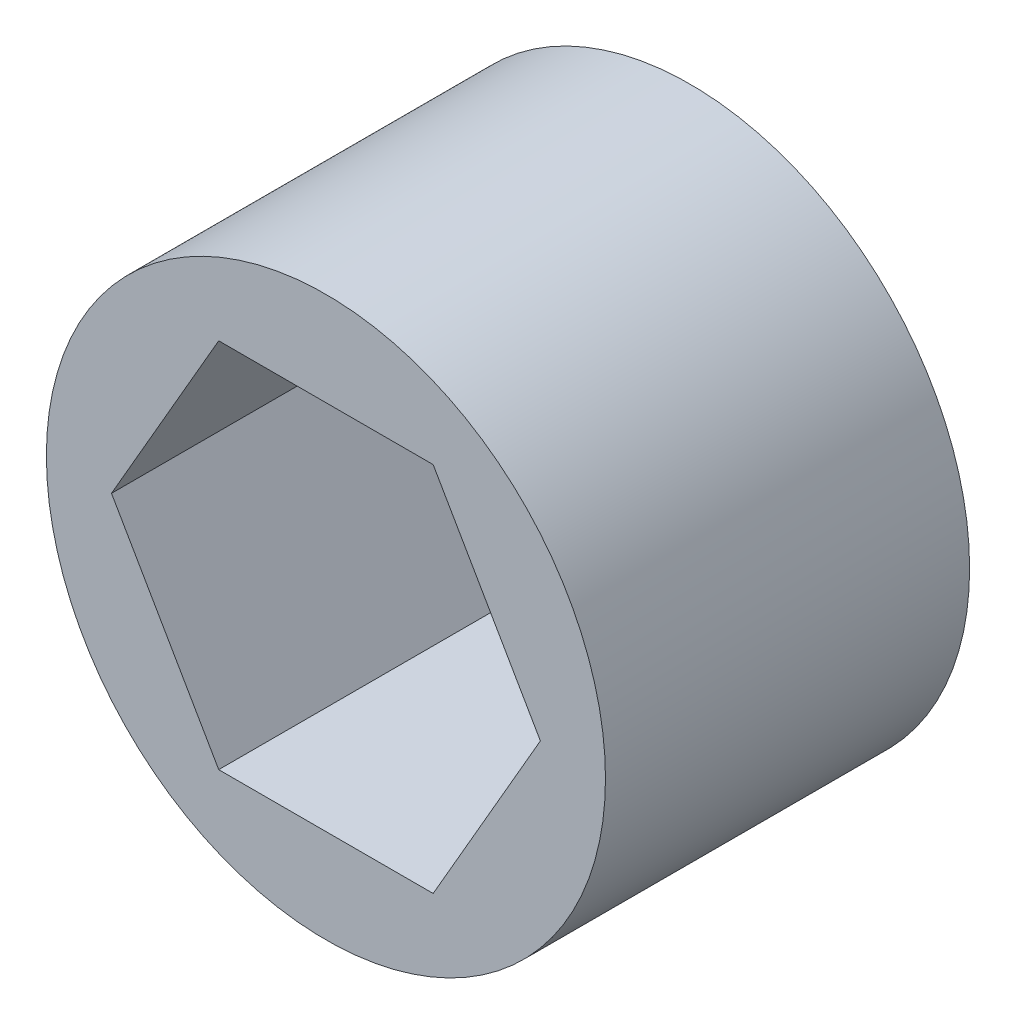
ISO-10303-21;
HEADER;
FILE_DESCRIPTION(('STEP AP214'),'2;1');
FILE_NAME('part.step','',(''),(''),'','','');
FILE_SCHEMA(('AUTOMOTIVE_DESIGN { 1 0 10303 214 1 1 1 1 }'));
ENDSEC;
DATA;
#1=APPLICATION_CONTEXT('core data for automotive mechanical design processes');
#2=APPLICATION_PROTOCOL_DEFINITION('international standard','automotive_design',2000,#1);
#3=PRODUCT_CONTEXT('',#1,'mechanical');
#4=PRODUCT('Part','Part','',(#3));
#5=PRODUCT_RELATED_PRODUCT_CATEGORY('part','',(#4));
#6=PRODUCT_DEFINITION_FORMATION('','',#4);
#7=PRODUCT_DEFINITION_CONTEXT('part definition',#1,'design');
#8=PRODUCT_DEFINITION('design','',#6,#7);
#9=PRODUCT_DEFINITION_SHAPE('','',#8);
#10=(LENGTH_UNIT() NAMED_UNIT(*) SI_UNIT(.MILLI.,.METRE.));
#11=(NAMED_UNIT(*) PLANE_ANGLE_UNIT() SI_UNIT($,.RADIAN.));
#12=(NAMED_UNIT(*) SI_UNIT($,.STERADIAN.) SOLID_ANGLE_UNIT());
#13=UNCERTAINTY_MEASURE_WITH_UNIT(LENGTH_MEASURE(1.E-05),#10,'distance_accuracy_value','');
#14=(GEOMETRIC_REPRESENTATION_CONTEXT(3) GLOBAL_UNCERTAINTY_ASSIGNED_CONTEXT((#13)) GLOBAL_UNIT_ASSIGNED_CONTEXT((#10,
#11,#12)) REPRESENTATION_CONTEXT('',''));
#15=CARTESIAN_POINT('',(0.,0.,0.));
#16=DIRECTION('',(0.,0.,1.));
#17=DIRECTION('',(1.,0.,0.));
#18=AXIS2_PLACEMENT_3D('',#15,#16,#17);
#19=CARTESIAN_POINT('',(-7.47899538708241,0.,6.35));
#20=DIRECTION('',(0.866025403784439,0.5,0.));
#21=DIRECTION('',(-0.5,0.866025403784439,0.));
#22=AXIS2_PLACEMENT_3D('',#19,#20,#21);
#23=PLANE('',#22);
#24=DIRECTION('',(-0.5,0.866025403784438,0.));
#25=VECTOR('',#24,1.);
#26=CARTESIAN_POINT('',(-3.73949769354121,-6.477,6.35));
#27=LINE('',#26,#25);
#28=CARTESIAN_POINT('',(-3.73949769354121,-6.477,6.35));
#29=VERTEX_POINT('',#28);
#30=CARTESIAN_POINT('',(-7.47899538708241,0.,6.35));
#31=VERTEX_POINT('',#30);
#32=EDGE_CURVE('E84',#29,#31,#27,.T.);
#33=ORIENTED_EDGE('',*,*,#32,.F.);
#34=DIRECTION('',(0.,0.,1.));
#35=VECTOR('',#34,1.);
#36=CARTESIAN_POINT('',(-3.73949769354121,-6.477,6.35));
#37=LINE('',#36,#35);
#38=CARTESIAN_POINT('',(-3.73949769354121,-6.477,-6.35));
#39=VERTEX_POINT('',#38);
#40=EDGE_CURVE('E76',#39,#29,#37,.T.);
#41=ORIENTED_EDGE('',*,*,#40,.F.);
#42=DIRECTION('',(-0.5,0.866025403784439,0.));
#43=VECTOR('',#42,1.);
#44=CARTESIAN_POINT('',(-3.73949769354121,-6.477,-6.35));
#45=LINE('',#44,#43);
#46=CARTESIAN_POINT('',(-7.47899538708241,0.,-6.35));
#47=VERTEX_POINT('',#46);
#48=EDGE_CURVE('E116',#39,#47,#45,.T.);
#49=ORIENTED_EDGE('',*,*,#48,.T.);
#50=DIRECTION('',(0.,0.,1.));
#51=VECTOR('',#50,1.);
#52=CARTESIAN_POINT('',(-7.47899538708241,0.,6.35));
#53=LINE('',#52,#51);
#54=EDGE_CURVE('E101',#31,#47,#53,.F.);
#55=ORIENTED_EDGE('',*,*,#54,.F.);
#56=EDGE_LOOP('',(#33,#41,#49,#55));
#57=FACE_BOUND('',#56,.T.);
#58=ADVANCED_FACE('F17',(#57),#23,.T.);
#59=CARTESIAN_POINT('',(-3.73949769354121,6.477,6.35));
#60=DIRECTION('',(0.866025403784439,-0.5,0.));
#61=DIRECTION('',(0.5,0.866025403784439,0.));
#62=AXIS2_PLACEMENT_3D('',#59,#60,#61);
#63=PLANE('',#62);
#64=DIRECTION('',(0.5,0.866025403784439,0.));
#65=VECTOR('',#64,1.);
#66=CARTESIAN_POINT('',(-7.47899538708242,0.,6.35));
#67=LINE('',#66,#65);
#68=CARTESIAN_POINT('',(-3.73949769354121,6.477,6.35));
#69=VERTEX_POINT('',#68);
#70=EDGE_CURVE('E109',#31,#69,#67,.T.);
#71=ORIENTED_EDGE('',*,*,#70,.F.);
#72=ORIENTED_EDGE('',*,*,#54,.T.);
#73=DIRECTION('',(0.5,0.866025403784439,0.));
#74=VECTOR('',#73,1.);
#75=CARTESIAN_POINT('',(-7.47899538708241,0.,-6.35));
#76=LINE('',#75,#74);
#77=CARTESIAN_POINT('',(-3.73949769354121,6.477,-6.35));
#78=VERTEX_POINT('',#77);
#79=EDGE_CURVE('E107',#47,#78,#76,.T.);
#80=ORIENTED_EDGE('',*,*,#79,.T.);
#81=DIRECTION('',(0.,0.,1.));
#82=VECTOR('',#81,1.);
#83=CARTESIAN_POINT('',(-3.73949769354121,6.477,6.35));
#84=LINE('',#83,#82);
#85=EDGE_CURVE('E98',#69,#78,#84,.F.);
#86=ORIENTED_EDGE('',*,*,#85,.F.);
#87=EDGE_LOOP('',(#71,#72,#80,#86));
#88=FACE_BOUND('',#87,.T.);
#89=ADVANCED_FACE('F106',(#88),#63,.T.);
#90=CARTESIAN_POINT('',(3.7394976935412,6.477,6.35));
#91=DIRECTION('',(0.,-1.,0.));
#92=DIRECTION('',(1.,0.,0.));
#93=AXIS2_PLACEMENT_3D('',#90,#91,#92);
#94=PLANE('',#93);
#95=DIRECTION('',(1.,0.,0.));
#96=VECTOR('',#95,1.);
#97=CARTESIAN_POINT('',(0.,6.477,6.35));
#98=LINE('',#97,#96);
#99=CARTESIAN_POINT('',(3.7394976935412,6.477,6.35));
#100=VERTEX_POINT('',#99);
#101=EDGE_CURVE('E126',#69,#100,#98,.T.);
#102=ORIENTED_EDGE('',*,*,#101,.F.);
#103=ORIENTED_EDGE('',*,*,#85,.T.);
#104=DIRECTION('',(1.,0.,0.));
#105=VECTOR('',#104,1.);
#106=CARTESIAN_POINT('',(0.,6.477,-6.35));
#107=LINE('',#106,#105);
#108=CARTESIAN_POINT('',(3.7394976935412,6.477,-6.35));
#109=VERTEX_POINT('',#108);
#110=EDGE_CURVE('E118',#78,#109,#107,.T.);
#111=ORIENTED_EDGE('',*,*,#110,.T.);
#112=DIRECTION('',(0.,0.,1.));
#113=VECTOR('',#112,1.);
#114=CARTESIAN_POINT('',(3.7394976935412,6.47700000000001,6.35));
#115=LINE('',#114,#113);
#116=EDGE_CURVE('E95',#100,#109,#115,.F.);
#117=ORIENTED_EDGE('',*,*,#116,.F.);
#118=EDGE_LOOP('',(#102,#103,#111,#117));
#119=FACE_BOUND('',#118,.T.);
#120=ADVANCED_FACE('F135',(#119),#94,.T.);
#121=CARTESIAN_POINT('',(7.47899538708241,0.,6.35));
#122=DIRECTION('',(-0.866025403784439,-0.5,0.));
#123=DIRECTION('',(0.5,-0.866025403784439,0.));
#124=AXIS2_PLACEMENT_3D('',#121,#122,#123);
#125=PLANE('',#124);
#126=DIRECTION('',(0.5,-0.866025403784438,0.));
#127=VECTOR('',#126,1.);
#128=CARTESIAN_POINT('',(3.7394976935412,6.477,6.35));
#129=LINE('',#128,#127);
#130=CARTESIAN_POINT('',(7.47899538708242,0.,6.35));
#131=VERTEX_POINT('',#130);
#132=EDGE_CURVE('E89',#100,#131,#129,.T.);
#133=ORIENTED_EDGE('',*,*,#132,.F.);
#134=ORIENTED_EDGE('',*,*,#116,.T.);
#135=DIRECTION('',(0.5,-0.866025403784438,0.));
#136=VECTOR('',#135,1.);
#137=CARTESIAN_POINT('',(3.7394976935412,6.477,-6.35));
#138=LINE('',#137,#136);
#139=CARTESIAN_POINT('',(7.47899538708241,0.,-6.35));
#140=VERTEX_POINT('',#139);
#141=EDGE_CURVE('E120',#109,#140,#138,.T.);
#142=ORIENTED_EDGE('',*,*,#141,.T.);
#143=DIRECTION('',(0.,0.,1.));
#144=VECTOR('',#143,1.);
#145=CARTESIAN_POINT('',(7.47899538708242,0.,6.35));
#146=LINE('',#145,#144);
#147=EDGE_CURVE('E65',#131,#140,#146,.F.);
#148=ORIENTED_EDGE('',*,*,#147,.F.);
#149=EDGE_LOOP('',(#133,#134,#142,#148));
#150=FACE_BOUND('',#149,.T.);
#151=ADVANCED_FACE('F132',(#150),#125,.T.);
#152=CARTESIAN_POINT('',(3.73949769354121,-6.477,6.35));
#153=DIRECTION('',(-0.866025403784439,0.5,0.));
#154=DIRECTION('',(-0.5,-0.866025403784439,0.));
#155=AXIS2_PLACEMENT_3D('',#152,#153,#154);
#156=PLANE('',#155);
#157=DIRECTION('',(-0.5,-0.866025403784439,0.));
#158=VECTOR('',#157,1.);
#159=CARTESIAN_POINT('',(7.47899538708241,0.,6.35));
#160=LINE('',#159,#158);
#161=CARTESIAN_POINT('',(3.73949769354121,-6.477,6.35));
#162=VERTEX_POINT('',#161);
#163=EDGE_CURVE('E71',#131,#162,#160,.T.);
#164=ORIENTED_EDGE('',*,*,#163,.F.);
#165=ORIENTED_EDGE('',*,*,#147,.T.);
#166=DIRECTION('',(-0.5,-0.866025403784439,0.));
#167=VECTOR('',#166,1.);
#168=CARTESIAN_POINT('',(7.47899538708241,0.,-6.35));
#169=LINE('',#168,#167);
#170=CARTESIAN_POINT('',(3.73949769354121,-6.477,-6.35));
#171=VERTEX_POINT('',#170);
#172=EDGE_CURVE('E33',#140,#171,#169,.T.);
#173=ORIENTED_EDGE('',*,*,#172,.T.);
#174=DIRECTION('',(0.,0.,1.));
#175=VECTOR('',#174,1.);
#176=CARTESIAN_POINT('',(3.73949769354121,-6.477,6.35));
#177=LINE('',#176,#175);
#178=EDGE_CURVE('E67',#162,#171,#177,.F.);
#179=ORIENTED_EDGE('',*,*,#178,.F.);
#180=EDGE_LOOP('',(#164,#165,#173,#179));
#181=FACE_BOUND('',#180,.T.);
#182=ADVANCED_FACE('F69',(#181),#156,.T.);
#183=CARTESIAN_POINT('',(-3.73949769354121,-6.477,6.35));
#184=DIRECTION('',(0.,1.,0.));
#185=DIRECTION('',(0.,0.,1.));
#186=AXIS2_PLACEMENT_3D('',#183,#184,#185);
#187=PLANE('',#186);
#188=DIRECTION('',(1.,0.,0.));
#189=VECTOR('',#188,1.);
#190=CARTESIAN_POINT('',(0.,-6.477,6.35));
#191=LINE('',#190,#189);
#192=EDGE_CURVE('E79',#162,#29,#191,.F.);
#193=ORIENTED_EDGE('',*,*,#192,.F.);
#194=ORIENTED_EDGE('',*,*,#178,.T.);
#195=DIRECTION('',(1.,0.,0.));
#196=VECTOR('',#195,1.);
#197=CARTESIAN_POINT('',(0.,-6.477,-6.35));
#198=LINE('',#197,#196);
#199=EDGE_CURVE('E128',#171,#39,#198,.F.);
#200=ORIENTED_EDGE('',*,*,#199,.T.);
#201=ORIENTED_EDGE('',*,*,#40,.T.);
#202=EDGE_LOOP('',(#193,#194,#200,#201));
#203=FACE_BOUND('',#202,.T.);
#204=ADVANCED_FACE('F80',(#203),#187,.T.);
#205=CARTESIAN_POINT('',(0.,0.,6.35));
#206=DIRECTION('',(0.,0.,1.));
#207=DIRECTION('',(1.,0.,0.));
#208=AXIS2_PLACEMENT_3D('',#205,#206,#207);
#209=PLANE('',#208);
#210=ORIENTED_EDGE('',*,*,#101,.T.);
#211=ORIENTED_EDGE('',*,*,#132,.T.);
#212=ORIENTED_EDGE('',*,*,#163,.T.);
#213=ORIENTED_EDGE('',*,*,#192,.T.);
#214=ORIENTED_EDGE('',*,*,#32,.T.);
#215=ORIENTED_EDGE('',*,*,#70,.T.);
#216=EDGE_LOOP('',(#210,#211,#212,#213,#214,#215));
#217=FACE_BOUND('',#216,.T.);
#218=CARTESIAN_POINT('',(0.,0.,6.35));
#219=DIRECTION('',(0.,0.,-1.));
#220=DIRECTION('',(-1.,0.,0.));
#221=AXIS2_PLACEMENT_3D('',#218,#219,#220);
#222=CIRCLE('',#221,9.75);
#223=CARTESIAN_POINT('',(-9.75,0.,6.35));
#224=VERTEX_POINT('',#223);
#225=EDGE_CURVE('E20',#224,#224,#222,.T.);
#226=ORIENTED_EDGE('',*,*,#225,.F.);
#227=EDGE_LOOP('',(#226));
#228=FACE_BOUND('',#227,.T.);
#229=ADVANCED_FACE('F87',(#217,#228),#209,.T.);
#230=CARTESIAN_POINT('',(0.,0.,-6.35));
#231=DIRECTION('',(0.,0.,1.));
#232=DIRECTION('',(1.,0.,0.));
#233=AXIS2_PLACEMENT_3D('',#230,#231,#232);
#234=PLANE('',#233);
#235=ORIENTED_EDGE('',*,*,#172,.F.);
#236=ORIENTED_EDGE('',*,*,#141,.F.);
#237=ORIENTED_EDGE('',*,*,#110,.F.);
#238=ORIENTED_EDGE('',*,*,#79,.F.);
#239=ORIENTED_EDGE('',*,*,#48,.F.);
#240=ORIENTED_EDGE('',*,*,#199,.F.);
#241=EDGE_LOOP('',(#235,#236,#237,#238,#239,#240));
#242=FACE_BOUND('',#241,.T.);
#243=CARTESIAN_POINT('',(0.,0.,-6.35));
#244=DIRECTION('',(0.,0.,-1.));
#245=DIRECTION('',(-1.,0.,0.));
#246=AXIS2_PLACEMENT_3D('',#243,#244,#245);
#247=CIRCLE('',#246,9.75);
#248=CARTESIAN_POINT('',(-9.75,0.,-6.35));
#249=VERTEX_POINT('',#248);
#250=EDGE_CURVE('E11',#249,#249,#247,.F.);
#251=ORIENTED_EDGE('',*,*,#250,.F.);
#252=EDGE_LOOP('',(#251));
#253=FACE_BOUND('',#252,.T.);
#254=ADVANCED_FACE('F114',(#242,#253),#234,.F.);
#255=CARTESIAN_POINT('',(0.,0.,6.35));
#256=DIRECTION('',(0.,0.,-1.));
#257=DIRECTION('',(-1.,0.,0.));
#258=AXIS2_PLACEMENT_3D('',#255,#256,#257);
#259=CYLINDRICAL_SURFACE('',#258,9.75);
#260=ORIENTED_EDGE('',*,*,#250,.T.);
#261=EDGE_LOOP('',(#260));
#262=FACE_BOUND('',#261,.T.);
#263=ORIENTED_EDGE('',*,*,#225,.T.);
#264=EDGE_LOOP('',(#263));
#265=FACE_BOUND('',#264,.T.);
#266=ADVANCED_FACE('F144',(#262,#265),#259,.T.);
#267=CLOSED_SHELL('',(#58,#89,#120,#151,#182,#204,#229,#254,#266));
#268=MANIFOLD_SOLID_BREP('B1',#267);
#269=ADVANCED_BREP_SHAPE_REPRESENTATION('',(#18,#268),#14);
#270=SHAPE_DEFINITION_REPRESENTATION(#9,#269);
ENDSEC;
END-ISO-10303-21;
